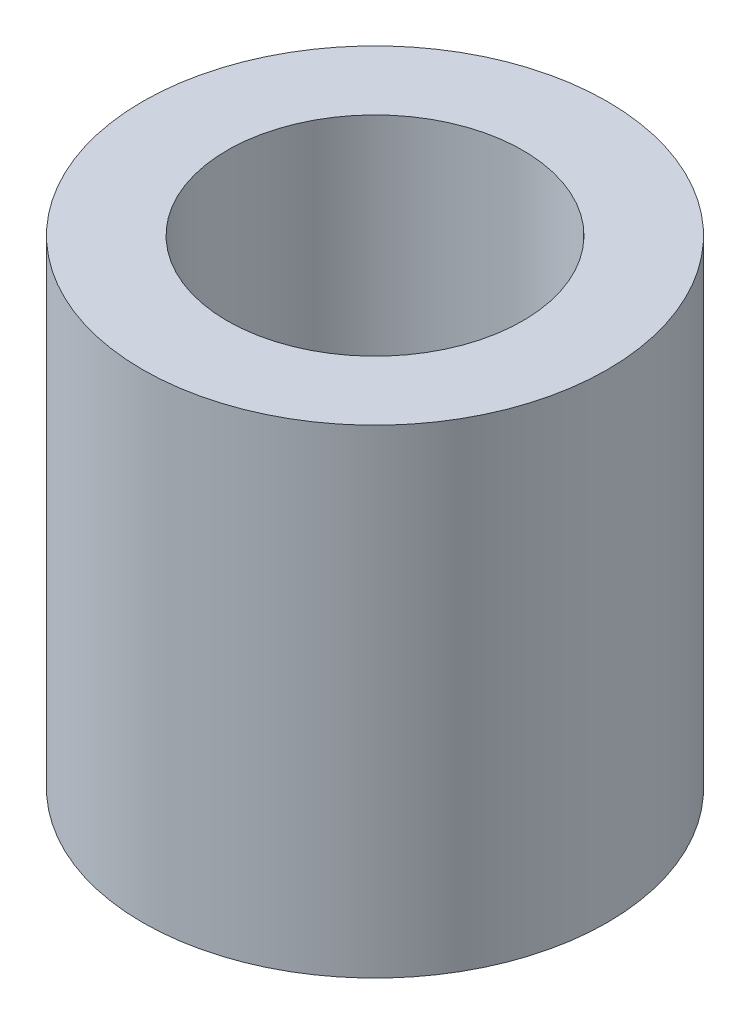
ISO-10303-21;
HEADER;
FILE_DESCRIPTION(('STEP AP214'),'2;1');
FILE_NAME('part.step','',(''),(''),'','','');
FILE_SCHEMA(('AUTOMOTIVE_DESIGN { 1 0 10303 214 1 1 1 1 }'));
ENDSEC;
DATA;
#1=APPLICATION_CONTEXT('core data for automotive mechanical design processes');
#2=APPLICATION_PROTOCOL_DEFINITION('international standard','automotive_design',2000,#1);
#3=PRODUCT_CONTEXT('',#1,'mechanical');
#4=PRODUCT('Part','Part','',(#3));
#5=PRODUCT_RELATED_PRODUCT_CATEGORY('part','',(#4));
#6=PRODUCT_DEFINITION_FORMATION('','',#4);
#7=PRODUCT_DEFINITION_CONTEXT('part definition',#1,'design');
#8=PRODUCT_DEFINITION('design','',#6,#7);
#9=PRODUCT_DEFINITION_SHAPE('','',#8);
#10=(LENGTH_UNIT() NAMED_UNIT(*) SI_UNIT(.MILLI.,.METRE.));
#11=(NAMED_UNIT(*) PLANE_ANGLE_UNIT() SI_UNIT($,.RADIAN.));
#12=(NAMED_UNIT(*) SI_UNIT($,.STERADIAN.) SOLID_ANGLE_UNIT());
#13=UNCERTAINTY_MEASURE_WITH_UNIT(LENGTH_MEASURE(1.E-05),#10,'distance_accuracy_value','');
#14=(GEOMETRIC_REPRESENTATION_CONTEXT(3) GLOBAL_UNCERTAINTY_ASSIGNED_CONTEXT((#13)) GLOBAL_UNIT_ASSIGNED_CONTEXT((#10,
#11,#12)) REPRESENTATION_CONTEXT('',''));
#15=CARTESIAN_POINT('',(0.,0.,0.));
#16=DIRECTION('',(0.,0.,1.));
#17=DIRECTION('',(1.,0.,0.));
#18=AXIS2_PLACEMENT_3D('',#15,#16,#17);
#19=CARTESIAN_POINT('',(0.,10.287,0.));
#20=DIRECTION('',(0.,1.,0.));
#21=DIRECTION('',(0.,0.,1.));
#22=AXIS2_PLACEMENT_3D('',#19,#20,#21);
#23=PLANE('',#22);
#24=CARTESIAN_POINT('',(0.,10.287,0.));
#25=DIRECTION('',(0.,1.,0.));
#26=DIRECTION('',(0.,0.,1.));
#27=AXIS2_PLACEMENT_3D('',#24,#25,#26);
#28=CIRCLE('',#27,4.9911);
#29=CARTESIAN_POINT('',(0.,10.287,4.9911));
#30=VERTEX_POINT('',#29);
#31=EDGE_CURVE('E10',#30,#30,#28,.T.);
#32=ORIENTED_EDGE('',*,*,#31,.T.);
#33=EDGE_LOOP('',(#32));
#34=FACE_BOUND('',#33,.T.);
#35=CARTESIAN_POINT('',(0.,10.287,0.));
#36=DIRECTION('',(0.,1.,0.));
#37=DIRECTION('',(0.,0.,1.));
#38=AXIS2_PLACEMENT_3D('',#35,#36,#37);
#39=CIRCLE('',#38,3.175);
#40=CARTESIAN_POINT('',(0.,10.287,3.175));
#41=VERTEX_POINT('',#40);
#42=EDGE_CURVE('E42',#41,#41,#39,.T.);
#43=ORIENTED_EDGE('',*,*,#42,.F.);
#44=EDGE_LOOP('',(#43));
#45=FACE_BOUND('',#44,.T.);
#46=ADVANCED_FACE('F31',(#34,#45),#23,.T.);
#47=CARTESIAN_POINT('',(0.,0.,0.));
#48=DIRECTION('',(0.,1.,0.));
#49=DIRECTION('',(0.,0.,1.));
#50=AXIS2_PLACEMENT_3D('',#47,#48,#49);
#51=PLANE('',#50);
#52=CARTESIAN_POINT('',(0.,0.,0.));
#53=DIRECTION('',(0.,1.,0.));
#54=DIRECTION('',(0.,0.,1.));
#55=AXIS2_PLACEMENT_3D('',#52,#53,#54);
#56=CIRCLE('',#55,4.9911);
#57=CARTESIAN_POINT('',(0.,0.,4.9911));
#58=VERTEX_POINT('',#57);
#59=EDGE_CURVE('E35',#58,#58,#56,.T.);
#60=ORIENTED_EDGE('',*,*,#59,.F.);
#61=EDGE_LOOP('',(#60));
#62=FACE_BOUND('',#61,.T.);
#63=CARTESIAN_POINT('',(0.,0.,0.));
#64=DIRECTION('',(0.,1.,0.));
#65=DIRECTION('',(0.,0.,1.));
#66=AXIS2_PLACEMENT_3D('',#63,#64,#65);
#67=CIRCLE('',#66,3.175);
#68=CARTESIAN_POINT('',(0.,0.,3.175));
#69=VERTEX_POINT('',#68);
#70=EDGE_CURVE('E44',#69,#69,#67,.T.);
#71=ORIENTED_EDGE('',*,*,#70,.T.);
#72=EDGE_LOOP('',(#71));
#73=FACE_BOUND('',#72,.T.);
#74=ADVANCED_FACE('F54',(#62,#73),#51,.F.);
#75=CARTESIAN_POINT('',(0.,10.287,0.));
#76=DIRECTION('',(0.,-1.,0.));
#77=DIRECTION('',(0.,0.,-1.));
#78=AXIS2_PLACEMENT_3D('',#75,#76,#77);
#79=CYLINDRICAL_SURFACE('',#78,4.9911);
#80=ORIENTED_EDGE('',*,*,#31,.F.);
#81=EDGE_LOOP('',(#80));
#82=FACE_BOUND('',#81,.T.);
#83=ORIENTED_EDGE('',*,*,#59,.T.);
#84=EDGE_LOOP('',(#83));
#85=FACE_BOUND('',#84,.T.);
#86=ADVANCED_FACE('F33',(#82,#85),#79,.T.);
#87=CARTESIAN_POINT('',(0.,10.287,0.));
#88=DIRECTION('',(0.,-1.,0.));
#89=DIRECTION('',(0.,0.,-1.));
#90=AXIS2_PLACEMENT_3D('',#87,#88,#89);
#91=CYLINDRICAL_SURFACE('',#90,3.175);
#92=ORIENTED_EDGE('',*,*,#42,.T.);
#93=EDGE_LOOP('',(#92));
#94=FACE_BOUND('',#93,.T.);
#95=ORIENTED_EDGE('',*,*,#70,.F.);
#96=EDGE_LOOP('',(#95));
#97=FACE_BOUND('',#96,.T.);
#98=ADVANCED_FACE('F50',(#94,#97),#91,.F.);
#99=CLOSED_SHELL('',(#46,#74,#86,#98));
#100=MANIFOLD_SOLID_BREP('B2',#99);
#101=ADVANCED_BREP_SHAPE_REPRESENTATION('',(#18,#100),#14);
#102=SHAPE_DEFINITION_REPRESENTATION(#9,#101);
ENDSEC;
END-ISO-10303-21;
